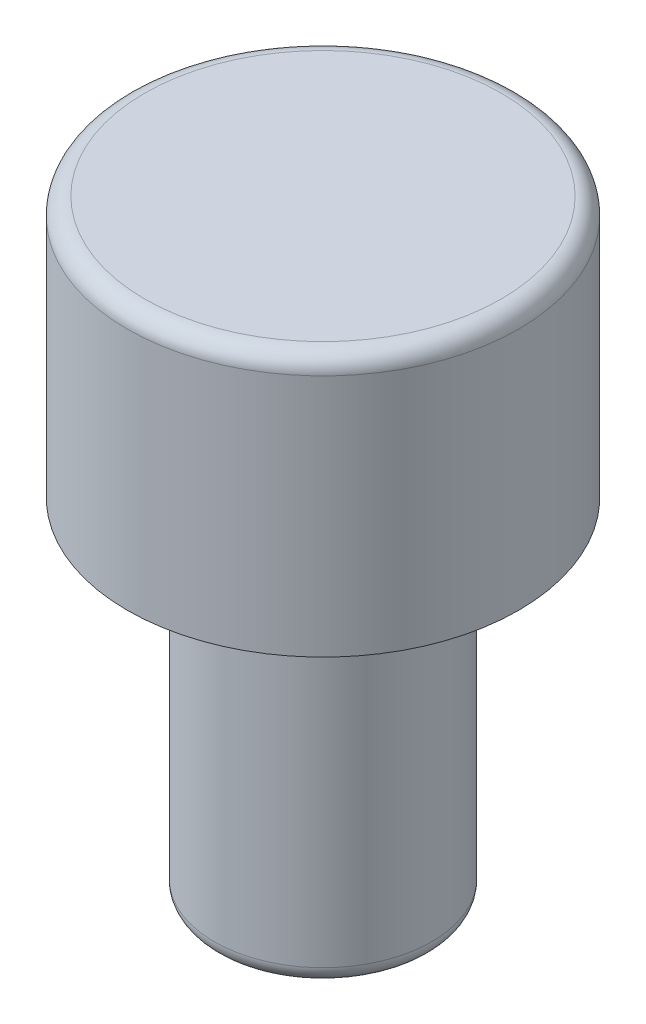
ISO-10303-21;
HEADER;
FILE_DESCRIPTION(('STEP AP214'),'2;1');
FILE_NAME('part.step','',(''),(''),'','','');
FILE_SCHEMA(('AUTOMOTIVE_DESIGN { 1 0 10303 214 1 1 1 1 }'));
ENDSEC;
DATA;
#1=APPLICATION_CONTEXT('core data for automotive mechanical design processes');
#2=APPLICATION_PROTOCOL_DEFINITION('international standard','automotive_design',2000,#1);
#3=PRODUCT_CONTEXT('',#1,'mechanical');
#4=PRODUCT('Part','Part','',(#3));
#5=PRODUCT_RELATED_PRODUCT_CATEGORY('part','',(#4));
#6=PRODUCT_DEFINITION_FORMATION('','',#4);
#7=PRODUCT_DEFINITION_CONTEXT('part definition',#1,'design');
#8=PRODUCT_DEFINITION('design','',#6,#7);
#9=PRODUCT_DEFINITION_SHAPE('','',#8);
#10=(LENGTH_UNIT() NAMED_UNIT(*) SI_UNIT(.MILLI.,.METRE.));
#11=(NAMED_UNIT(*) PLANE_ANGLE_UNIT() SI_UNIT($,.RADIAN.));
#12=(NAMED_UNIT(*) SI_UNIT($,.STERADIAN.) SOLID_ANGLE_UNIT());
#13=UNCERTAINTY_MEASURE_WITH_UNIT(LENGTH_MEASURE(1.E-05),#10,'distance_accuracy_value','');
#14=(GEOMETRIC_REPRESENTATION_CONTEXT(3) GLOBAL_UNCERTAINTY_ASSIGNED_CONTEXT((#13)) GLOBAL_UNIT_ASSIGNED_CONTEXT((#10,
#11,#12)) REPRESENTATION_CONTEXT('',''));
#15=CARTESIAN_POINT('',(0.,0.,0.));
#16=DIRECTION('',(0.,0.,1.));
#17=DIRECTION('',(1.,0.,0.));
#18=AXIS2_PLACEMENT_3D('',#15,#16,#17);
#19=CARTESIAN_POINT('',(0.,0.,0.));
#20=DIRECTION('',(0.,1.,0.));
#21=DIRECTION('',(-1.,0.,0.));
#22=AXIS2_PLACEMENT_3D('',#19,#20,#21);
#23=PLANE('',#22);
#24=CARTESIAN_POINT('',(0.,0.,0.));
#25=DIRECTION('',(0.,1.,0.));
#26=DIRECTION('',(-1.,0.,0.));
#27=AXIS2_PLACEMENT_3D('',#24,#25,#26);
#28=CIRCLE('',#27,2.25);
#29=CARTESIAN_POINT('',(-2.25,0.,0.));
#30=VERTEX_POINT('',#29);
#31=EDGE_CURVE('E53',#30,#30,#28,.T.);
#32=ORIENTED_EDGE('',*,*,#31,.F.);
#33=EDGE_LOOP('',(#32));
#34=FACE_BOUND('',#33,.T.);
#35=CARTESIAN_POINT('',(0.,0.,0.));
#36=DIRECTION('',(0.,1.,0.));
#37=DIRECTION('',(-1.,0.,0.));
#38=AXIS2_PLACEMENT_3D('',#35,#36,#37);
#39=CIRCLE('',#38,1.25);
#40=CARTESIAN_POINT('',(-1.25,0.,0.));
#41=VERTEX_POINT('',#40);
#42=EDGE_CURVE('E56',#41,#41,#39,.T.);
#43=ORIENTED_EDGE('',*,*,#42,.T.);
#44=EDGE_LOOP('',(#43));
#45=FACE_BOUND('',#44,.T.);
#46=ADVANCED_FACE('F33',(#34,#45),#23,.F.);
#47=CARTESIAN_POINT('',(0.,0.,0.));
#48=DIRECTION('',(0.,1.,0.));
#49=DIRECTION('',(-1.,0.,0.));
#50=AXIS2_PLACEMENT_3D('',#47,#48,#49);
#51=CYLINDRICAL_SURFACE('',#50,2.25);
#52=CARTESIAN_POINT('',(0.,2.8,0.));
#53=DIRECTION('',(0.,1.,0.));
#54=DIRECTION('',(-1.,0.,0.));
#55=AXIS2_PLACEMENT_3D('',#52,#53,#54);
#56=CIRCLE('',#55,2.25);
#57=CARTESIAN_POINT('',(-2.25,2.8,0.));
#58=VERTEX_POINT('',#57);
#59=EDGE_CURVE('E44',#58,#58,#56,.F.);
#60=ORIENTED_EDGE('',*,*,#59,.T.);
#61=EDGE_LOOP('',(#60));
#62=FACE_BOUND('',#61,.T.);
#63=ORIENTED_EDGE('',*,*,#31,.T.);
#64=EDGE_LOOP('',(#63));
#65=FACE_BOUND('',#64,.T.);
#66=ADVANCED_FACE('F74',(#62,#65),#51,.T.);
#67=CARTESIAN_POINT('',(0.,3.,0.));
#68=DIRECTION('',(0.,1.,0.));
#69=DIRECTION('',(-1.,0.,0.));
#70=AXIS2_PLACEMENT_3D('',#67,#68,#69);
#71=PLANE('',#70);
#72=CARTESIAN_POINT('',(0.,3.,0.));
#73=DIRECTION('',(0.,1.,0.));
#74=DIRECTION('',(-1.,0.,0.));
#75=AXIS2_PLACEMENT_3D('',#72,#73,#74);
#76=CIRCLE('',#75,2.05);
#77=CARTESIAN_POINT('',(-2.05,3.,0.));
#78=VERTEX_POINT('',#77);
#79=EDGE_CURVE('E48',#78,#78,#76,.T.);
#80=ORIENTED_EDGE('',*,*,#79,.T.);
#81=EDGE_LOOP('',(#80));
#82=FACE_BOUND('',#81,.T.);
#83=ADVANCED_FACE('F71',(#82),#71,.T.);
#84=CARTESIAN_POINT('',(0.,-4.,0.));
#85=DIRECTION('',(0.,1.,0.));
#86=DIRECTION('',(-1.,0.,0.));
#87=AXIS2_PLACEMENT_3D('',#84,#85,#86);
#88=PLANE('',#87);
#89=CARTESIAN_POINT('',(0.,-4.,0.));
#90=DIRECTION('',(0.,1.,0.));
#91=DIRECTION('',(-1.,0.,0.));
#92=AXIS2_PLACEMENT_3D('',#89,#90,#91);
#93=CIRCLE('',#92,1.05);
#94=CARTESIAN_POINT('',(-1.05,-4.,0.));
#95=VERTEX_POINT('',#94);
#96=EDGE_CURVE('E10',#95,#95,#93,.F.);
#97=ORIENTED_EDGE('',*,*,#96,.T.);
#98=EDGE_LOOP('',(#97));
#99=FACE_BOUND('',#98,.T.);
#100=ADVANCED_FACE('F64',(#99),#88,.F.);
#101=CARTESIAN_POINT('',(0.,0.,0.));
#102=DIRECTION('',(0.,1.,0.));
#103=DIRECTION('',(-1.,0.,0.));
#104=AXIS2_PLACEMENT_3D('',#101,#102,#103);
#105=CYLINDRICAL_SURFACE('',#104,1.25);
#106=CARTESIAN_POINT('',(0.,-3.8,0.));
#107=DIRECTION('',(0.,1.,0.));
#108=DIRECTION('',(-1.,0.,0.));
#109=AXIS2_PLACEMENT_3D('',#106,#107,#108);
#110=CIRCLE('',#109,1.25);
#111=CARTESIAN_POINT('',(-1.25,-3.8,0.));
#112=VERTEX_POINT('',#111);
#113=EDGE_CURVE('E40',#112,#112,#110,.T.);
#114=ORIENTED_EDGE('',*,*,#113,.T.);
#115=EDGE_LOOP('',(#114));
#116=FACE_BOUND('',#115,.T.);
#117=ORIENTED_EDGE('',*,*,#42,.F.);
#118=EDGE_LOOP('',(#117));
#119=FACE_BOUND('',#118,.T.);
#120=ADVANCED_FACE('F61',(#116,#119),#105,.T.);
#121=CARTESIAN_POINT('',(0.,2.8,0.));
#122=DIRECTION('',(0.,1.,0.));
#123=DIRECTION('',(-1.,0.,0.));
#124=AXIS2_PLACEMENT_3D('',#121,#122,#123);
#125=TOROIDAL_SURFACE('',#124,2.05,0.2);
#126=ORIENTED_EDGE('',*,*,#59,.F.);
#127=EDGE_LOOP('',(#126));
#128=FACE_BOUND('',#127,.T.);
#129=ORIENTED_EDGE('',*,*,#79,.F.);
#130=EDGE_LOOP('',(#129));
#131=FACE_BOUND('',#130,.T.);
#132=ADVANCED_FACE('F63',(#128,#131),#125,.T.);
#133=CARTESIAN_POINT('',(0.,-3.8,0.));
#134=DIRECTION('',(0.,1.,0.));
#135=DIRECTION('',(-1.,0.,0.));
#136=AXIS2_PLACEMENT_3D('',#133,#134,#135);
#137=TOROIDAL_SURFACE('',#136,1.05,0.2);
#138=ORIENTED_EDGE('',*,*,#96,.F.);
#139=EDGE_LOOP('',(#138));
#140=FACE_BOUND('',#139,.T.);
#141=ORIENTED_EDGE('',*,*,#113,.F.);
#142=EDGE_LOOP('',(#141));
#143=FACE_BOUND('',#142,.T.);
#144=ADVANCED_FACE('F35',(#140,#143),#137,.T.);
#145=CLOSED_SHELL('',(#46,#66,#83,#100,#120,#132,#144));
#146=MANIFOLD_SOLID_BREP('B2',#145);
#147=ADVANCED_BREP_SHAPE_REPRESENTATION('',(#18,#146),#14);
#148=SHAPE_DEFINITION_REPRESENTATION(#9,#147);
ENDSEC;
END-ISO-10303-21;
